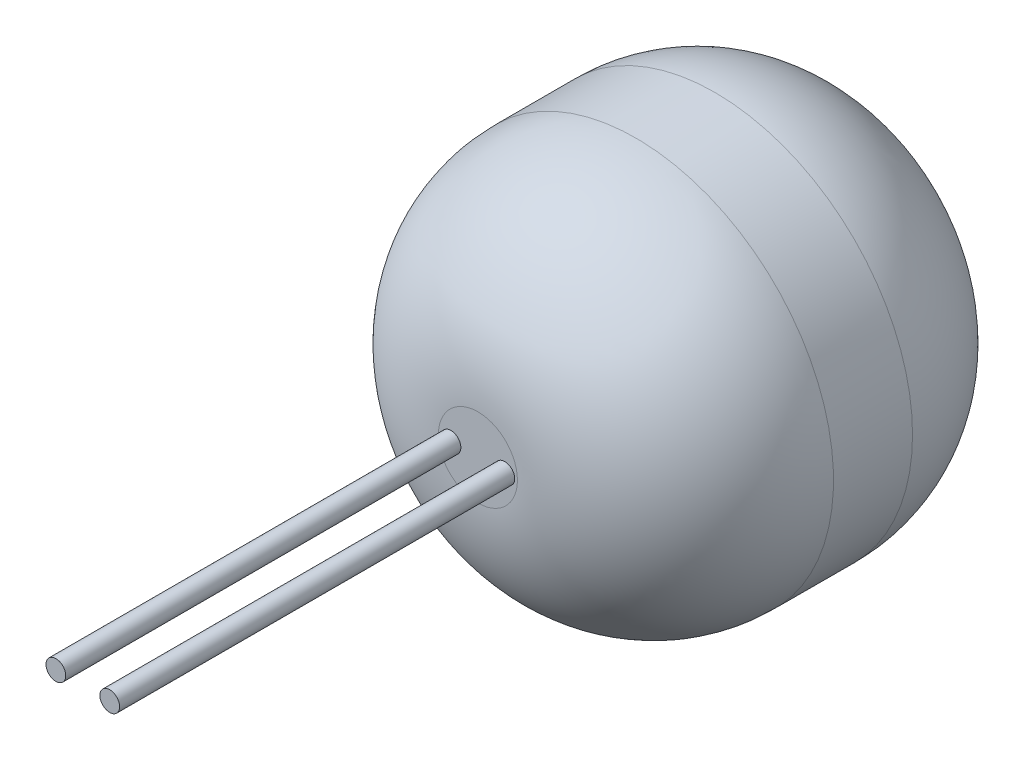
ISO-10303-21;
HEADER;
FILE_DESCRIPTION(('STEP AP214'),'2;1');
FILE_NAME('part.step','',(''),(''),'','','');
FILE_SCHEMA(('AUTOMOTIVE_DESIGN { 1 0 10303 214 1 1 1 1 }'));
ENDSEC;
DATA;
#1=APPLICATION_CONTEXT('core data for automotive mechanical design processes');
#2=APPLICATION_PROTOCOL_DEFINITION('international standard','automotive_design',2000,#1);
#3=PRODUCT_CONTEXT('',#1,'mechanical');
#4=PRODUCT('Part','Part','',(#3));
#5=PRODUCT_RELATED_PRODUCT_CATEGORY('part','',(#4));
#6=PRODUCT_DEFINITION_FORMATION('','',#4);
#7=PRODUCT_DEFINITION_CONTEXT('part definition',#1,'design');
#8=PRODUCT_DEFINITION('design','',#6,#7);
#9=PRODUCT_DEFINITION_SHAPE('','',#8);
#10=(LENGTH_UNIT() NAMED_UNIT(*) SI_UNIT(.MILLI.,.METRE.));
#11=(NAMED_UNIT(*) PLANE_ANGLE_UNIT() SI_UNIT($,.RADIAN.));
#12=(NAMED_UNIT(*) SI_UNIT($,.STERADIAN.) SOLID_ANGLE_UNIT());
#13=UNCERTAINTY_MEASURE_WITH_UNIT(LENGTH_MEASURE(1.E-05),#10,'distance_accuracy_value','');
#14=(GEOMETRIC_REPRESENTATION_CONTEXT(3) GLOBAL_UNCERTAINTY_ASSIGNED_CONTEXT((#13)) GLOBAL_UNIT_ASSIGNED_CONTEXT((#10,
#11,#12)) REPRESENTATION_CONTEXT('',''));
#15=CARTESIAN_POINT('',(0.,0.,0.));
#16=DIRECTION('',(0.,0.,1.));
#17=DIRECTION('',(1.,0.,0.));
#18=AXIS2_PLACEMENT_3D('',#15,#16,#17);
#19=CARTESIAN_POINT('',(0.136233706431234,0.,4.));
#20=DIRECTION('',(0.,0.,1.));
#21=DIRECTION('',(1.,0.,0.));
#22=AXIS2_PLACEMENT_3D('',#19,#20,#21);
#23=PLANE('',#22);
#24=CARTESIAN_POINT('',(0.136233706431234,0.,4.));
#25=DIRECTION('',(0.,0.,-1.));
#26=DIRECTION('',(-1.,0.,0.));
#27=AXIS2_PLACEMENT_3D('',#24,#25,#26);
#28=CIRCLE('',#27,0.05);
#29=CARTESIAN_POINT('',(0.0862337064312338,0.,4.));
#30=VERTEX_POINT('',#29);
#31=EDGE_CURVE('E60',#30,#30,#28,.T.);
#32=ORIENTED_EDGE('',*,*,#31,.F.);
#33=EDGE_LOOP('',(#32));
#34=FACE_BOUND('',#33,.T.);
#35=ADVANCED_FACE('F17',(#34),#23,.T.);
#36=CARTESIAN_POINT('',(-0.136275076217566,0.,4.));
#37=DIRECTION('',(0.,0.,1.));
#38=DIRECTION('',(1.,0.,0.));
#39=AXIS2_PLACEMENT_3D('',#36,#37,#38);
#40=PLANE('',#39);
#41=CARTESIAN_POINT('',(-0.136275076217566,0.,4.));
#42=DIRECTION('',(0.,0.,-1.));
#43=DIRECTION('',(-1.,0.,0.));
#44=AXIS2_PLACEMENT_3D('',#41,#42,#43);
#45=CIRCLE('',#44,0.05);
#46=CARTESIAN_POINT('',(-0.186275076217566,0.,4.));
#47=VERTEX_POINT('',#46);
#48=EDGE_CURVE('E57',#47,#47,#45,.T.);
#49=ORIENTED_EDGE('',*,*,#48,.F.);
#50=EDGE_LOOP('',(#49));
#51=FACE_BOUND('',#50,.T.);
#52=ADVANCED_FACE('F161',(#51),#40,.T.);
#53=CARTESIAN_POINT('',(0.136233706431234,0.,4.));
#54=DIRECTION('',(0.,0.,-1.));
#55=DIRECTION('',(-1.,0.,0.));
#56=AXIS2_PLACEMENT_3D('',#53,#54,#55);
#57=CYLINDRICAL_SURFACE('',#56,0.05);
#58=CARTESIAN_POINT('',(0.136233706431234,0.,2.));
#59=DIRECTION('',(0.,0.,-1.));
#60=DIRECTION('',(-1.,0.,0.));
#61=AXIS2_PLACEMENT_3D('',#58,#59,#60);
#62=CIRCLE('',#61,0.05);
#63=CARTESIAN_POINT('',(0.0862337064312338,0.,2.));
#64=VERTEX_POINT('',#63);
#65=EDGE_CURVE('E56',#64,#64,#62,.T.);
#66=ORIENTED_EDGE('',*,*,#65,.F.);
#67=EDGE_LOOP('',(#66));
#68=FACE_BOUND('',#67,.T.);
#69=ORIENTED_EDGE('',*,*,#31,.T.);
#70=EDGE_LOOP('',(#69));
#71=FACE_BOUND('',#70,.T.);
#72=ADVANCED_FACE('F158',(#68,#71),#57,.T.);
#73=CARTESIAN_POINT('',(-0.136275076217566,0.,4.));
#74=DIRECTION('',(0.,0.,-1.));
#75=DIRECTION('',(-1.,0.,0.));
#76=AXIS2_PLACEMENT_3D('',#73,#74,#75);
#77=CYLINDRICAL_SURFACE('',#76,0.05);
#78=CARTESIAN_POINT('',(-0.136275076217566,0.,2.));
#79=DIRECTION('',(0.,0.,-1.));
#80=DIRECTION('',(-1.,0.,0.));
#81=AXIS2_PLACEMENT_3D('',#78,#79,#80);
#82=CIRCLE('',#81,0.05);
#83=CARTESIAN_POINT('',(-0.186275076217566,0.,2.));
#84=VERTEX_POINT('',#83);
#85=EDGE_CURVE('E148',#84,#84,#82,.T.);
#86=ORIENTED_EDGE('',*,*,#85,.F.);
#87=EDGE_LOOP('',(#86));
#88=FACE_BOUND('',#87,.T.);
#89=ORIENTED_EDGE('',*,*,#48,.T.);
#90=EDGE_LOOP('',(#89));
#91=FACE_BOUND('',#90,.T.);
#92=ADVANCED_FACE('F125',(#88,#91),#77,.T.);
#93=CARTESIAN_POINT('',(0.,0.,2.));
#94=DIRECTION('',(0.,0.,1.));
#95=DIRECTION('',(1.,0.,0.));
#96=AXIS2_PLACEMENT_3D('',#93,#94,#95);
#97=PLANE('',#96);
#98=CARTESIAN_POINT('',(0.,0.,2.));
#99=DIRECTION('',(0.,0.,-1.));
#100=DIRECTION('',(-1.,0.,0.));
#101=AXIS2_PLACEMENT_3D('',#98,#99,#100);
#102=CIRCLE('',#101,0.2);
#103=CARTESIAN_POINT('',(0.2,0.,2.));
#104=VERTEX_POINT('',#103);
#105=CARTESIAN_POINT('',(-0.2,0.,2.));
#106=VERTEX_POINT('',#105);
#107=EDGE_CURVE('E34',#104,#106,#102,.F.);
#108=ORIENTED_EDGE('',*,*,#107,.T.);
#109=CARTESIAN_POINT('',(0.,0.,2.));
#110=DIRECTION('',(0.,0.,-1.));
#111=DIRECTION('',(1.,0.,0.));
#112=AXIS2_PLACEMENT_3D('',#109,#110,#111);
#113=CIRCLE('',#112,0.2);
#114=EDGE_CURVE('E137',#104,#106,#113,.T.);
#115=ORIENTED_EDGE('',*,*,#114,.F.);
#116=EDGE_LOOP('',(#108,#115));
#117=FACE_BOUND('',#116,.T.);
#118=ORIENTED_EDGE('',*,*,#85,.T.);
#119=EDGE_LOOP('',(#118));
#120=FACE_BOUND('',#119,.T.);
#121=ORIENTED_EDGE('',*,*,#65,.T.);
#122=EDGE_LOOP('',(#121));
#123=FACE_BOUND('',#122,.T.);
#124=ADVANCED_FACE('F116',(#117,#120,#123),#97,.T.);
#125=CARTESIAN_POINT('',(0.2,0.,1.2));
#126=DIRECTION('',(0.,1.,0.));
#127=DIRECTION('',(1.,0.,0.));
#128=AXIS2_PLACEMENT_3D('',#125,#126,#127);
#129=CIRCLE('',#128,0.8);
#130=TRIMMED_CURVE('',#129,(PARAMETER_VALUE(-1.82347658193698)),
(PARAMETER_VALUE(1.82347658193698)),.T.,.PARAMETER.);
#131=CARTESIAN_POINT('',(0.,0.,1.2));
#132=DIRECTION('',(0.,0.,1.));
#133=AXIS1_PLACEMENT('',#131,#132);
#134=SURFACE_OF_REVOLUTION('',#130,#133);
#135=ORIENTED_EDGE('',*,*,#114,.T.);
#136=ORIENTED_EDGE('',*,*,#107,.F.);
#137=EDGE_LOOP('',(#135,#136));
#138=FACE_BOUND('',#137,.T.);
#139=CARTESIAN_POINT('',(0.,0.,1.2));
#140=DIRECTION('',(0.,0.,-1.));
#141=DIRECTION('',(-1.,0.,0.));
#142=AXIS2_PLACEMENT_3D('',#139,#140,#141);
#143=CIRCLE('',#142,1.);
#144=CARTESIAN_POINT('',(-1.,0.,1.2));
#145=VERTEX_POINT('',#144);
#146=EDGE_CURVE('E51',#145,#145,#143,.T.);
#147=ORIENTED_EDGE('',*,*,#146,.F.);
#148=EDGE_LOOP('',(#147));
#149=FACE_BOUND('',#148,.T.);
#150=ADVANCED_FACE('F89',(#138,#149),#134,.F.);
#151=CARTESIAN_POINT('',(0.,0.,0.));
#152=DIRECTION('',(0.,0.,1.));
#153=DIRECTION('',(1.,0.,0.));
#154=AXIS2_PLACEMENT_3D('',#151,#152,#153);
#155=PLANE('',#154);
#156=CARTESIAN_POINT('',(0.,0.,0.));
#157=DIRECTION('',(0.,0.,1.));
#158=DIRECTION('',(1.,0.,0.));
#159=AXIS2_PLACEMENT_3D('',#156,#157,#158);
#160=CIRCLE('',#159,0.2);
#161=CARTESIAN_POINT('',(0.2,0.,0.));
#162=VERTEX_POINT('',#161);
#163=CARTESIAN_POINT('',(-0.2,0.,0.));
#164=VERTEX_POINT('',#163);
#165=EDGE_CURVE('E47',#162,#164,#160,.T.);
#166=ORIENTED_EDGE('',*,*,#165,.F.);
#167=CARTESIAN_POINT('',(0.,0.,0.));
#168=DIRECTION('',(0.,0.,1.));
#169=DIRECTION('',(-1.,0.,0.));
#170=AXIS2_PLACEMENT_3D('',#167,#168,#169);
#171=CIRCLE('',#170,0.2);
#172=EDGE_CURVE('E28',#164,#162,#171,.T.);
#173=ORIENTED_EDGE('',*,*,#172,.F.);
#174=EDGE_LOOP('',(#166,#173));
#175=FACE_BOUND('',#174,.T.);
#176=ADVANCED_FACE('F46',(#175),#155,.F.);
#177=CARTESIAN_POINT('',(0.,0.,2.));
#178=DIRECTION('',(0.,0.,-1.));
#179=DIRECTION('',(-1.,0.,0.));
#180=AXIS2_PLACEMENT_3D('',#177,#178,#179);
#181=CYLINDRICAL_SURFACE('',#180,1.);
#182=ORIENTED_EDGE('',*,*,#146,.T.);
#183=EDGE_LOOP('',(#182));
#184=FACE_BOUND('',#183,.T.);
#185=CARTESIAN_POINT('',(0.,0.,0.8));
#186=DIRECTION('',(0.,0.,1.));
#187=DIRECTION('',(1.,0.,0.));
#188=AXIS2_PLACEMENT_3D('',#185,#186,#187);
#189=CIRCLE('',#188,1.);
#190=CARTESIAN_POINT('',(1.,0.,0.8));
#191=VERTEX_POINT('',#190);
#192=EDGE_CURVE('E10',#191,#191,#189,.F.);
#193=ORIENTED_EDGE('',*,*,#192,.F.);
#194=EDGE_LOOP('',(#193));
#195=FACE_BOUND('',#194,.T.);
#196=ADVANCED_FACE('F74',(#184,#195),#181,.T.);
#197=CARTESIAN_POINT('',(0.2,0.,0.8));
#198=DIRECTION('',(0.,1.,0.));
#199=DIRECTION('',(1.,0.,0.));
#200=AXIS2_PLACEMENT_3D('',#197,#198,#199);
#201=CIRCLE('',#200,0.8);
#202=TRIMMED_CURVE('',#201,(PARAMETER_VALUE(-1.82347658193698)),
(PARAMETER_VALUE(1.82347658193698)),.T.,.PARAMETER.);
#203=CARTESIAN_POINT('',(0.,0.,0.8));
#204=DIRECTION('',(0.,0.,1.));
#205=AXIS1_PLACEMENT('',#203,#204);
#206=SURFACE_OF_REVOLUTION('',#202,#205);
#207=ORIENTED_EDGE('',*,*,#192,.T.);
#208=EDGE_LOOP('',(#207));
#209=FACE_BOUND('',#208,.T.);
#210=ORIENTED_EDGE('',*,*,#172,.T.);
#211=ORIENTED_EDGE('',*,*,#165,.T.);
#212=EDGE_LOOP('',(#210,#211));
#213=FACE_BOUND('',#212,.T.);
#214=ADVANCED_FACE('F55',(#209,#213),#206,.F.);
#215=CLOSED_SHELL('',(#35,#52,#72,#92,#124,#150,#176,#196,#214));
#216=MANIFOLD_SOLID_BREP('B1',#215);
#217=ADVANCED_BREP_SHAPE_REPRESENTATION('',(#18,#216),#14);
#218=SHAPE_DEFINITION_REPRESENTATION(#9,#217);
ENDSEC;
END-ISO-10303-21;
